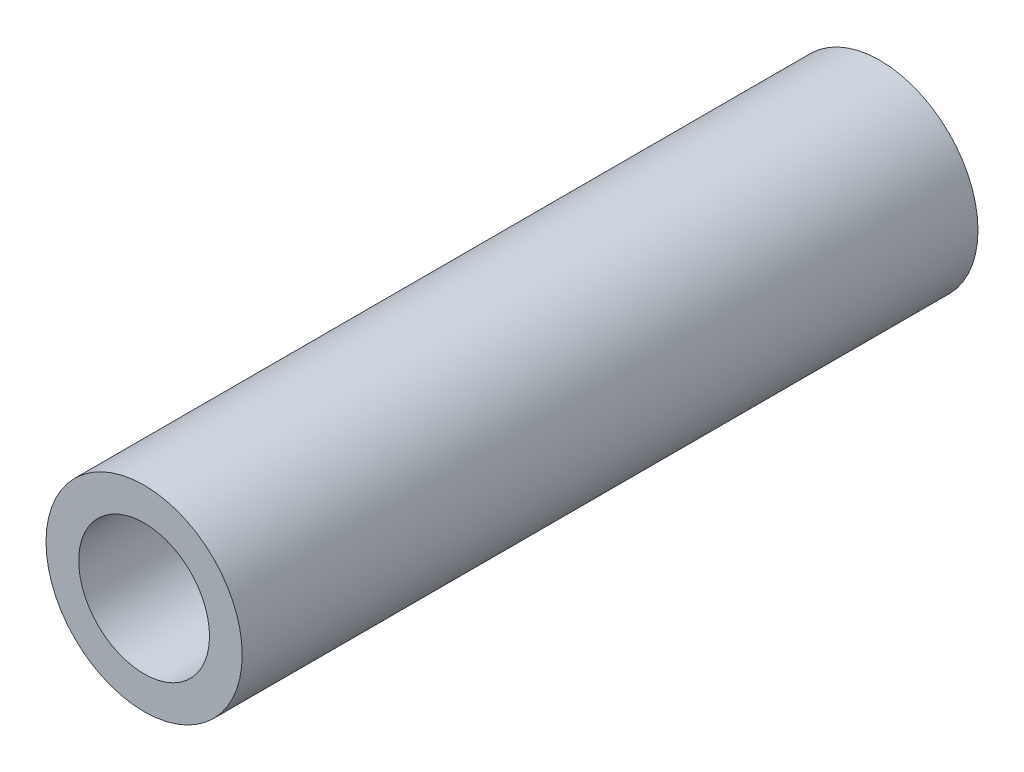
ISO-10303-21;
HEADER;
FILE_DESCRIPTION(('STEP AP214'),'2;1');
FILE_NAME('part.step','',(''),(''),'','','');
FILE_SCHEMA(('AUTOMOTIVE_DESIGN { 1 0 10303 214 1 1 1 1 }'));
ENDSEC;
DATA;
#1=APPLICATION_CONTEXT('core data for automotive mechanical design processes');
#2=APPLICATION_PROTOCOL_DEFINITION('international standard','automotive_design',2000,#1);
#3=PRODUCT_CONTEXT('',#1,'mechanical');
#4=PRODUCT('Part','Part','',(#3));
#5=PRODUCT_RELATED_PRODUCT_CATEGORY('part','',(#4));
#6=PRODUCT_DEFINITION_FORMATION('','',#4);
#7=PRODUCT_DEFINITION_CONTEXT('part definition',#1,'design');
#8=PRODUCT_DEFINITION('design','',#6,#7);
#9=PRODUCT_DEFINITION_SHAPE('','',#8);
#10=(LENGTH_UNIT() NAMED_UNIT(*) SI_UNIT(.MILLI.,.METRE.));
#11=(NAMED_UNIT(*) PLANE_ANGLE_UNIT() SI_UNIT($,.RADIAN.));
#12=(NAMED_UNIT(*) SI_UNIT($,.STERADIAN.) SOLID_ANGLE_UNIT());
#13=UNCERTAINTY_MEASURE_WITH_UNIT(LENGTH_MEASURE(1.E-05),#10,'distance_accuracy_value','');
#14=(GEOMETRIC_REPRESENTATION_CONTEXT(3) GLOBAL_UNCERTAINTY_ASSIGNED_CONTEXT((#13)) GLOBAL_UNIT_ASSIGNED_CONTEXT((#10,
#11,#12)) REPRESENTATION_CONTEXT('',''));
#15=CARTESIAN_POINT('',(0.,0.,0.));
#16=DIRECTION('',(0.,0.,1.));
#17=DIRECTION('',(1.,0.,0.));
#18=AXIS2_PLACEMENT_3D('',#15,#16,#17);
#19=CARTESIAN_POINT('',(0.,0.,57.15));
#20=DIRECTION('',(0.,0.,1.));
#21=DIRECTION('',(1.,0.,0.));
#22=AXIS2_PLACEMENT_3D('',#19,#20,#21);
#23=PLANE('',#22);
#24=CARTESIAN_POINT('',(0.,0.,57.15));
#25=DIRECTION('',(0.,0.,1.));
#26=DIRECTION('',(1.,0.,0.));
#27=AXIS2_PLACEMENT_3D('',#24,#25,#26);
#28=CIRCLE('',#27,7.62);
#29=CARTESIAN_POINT('',(7.62,0.,57.15));
#30=VERTEX_POINT('',#29);
#31=EDGE_CURVE('E10',#30,#30,#28,.T.);
#32=ORIENTED_EDGE('',*,*,#31,.T.);
#33=EDGE_LOOP('',(#32));
#34=FACE_BOUND('',#33,.T.);
#35=CARTESIAN_POINT('',(0.,0.,57.15));
#36=DIRECTION('',(0.,0.,1.));
#37=DIRECTION('',(1.,0.,0.));
#38=AXIS2_PLACEMENT_3D('',#35,#36,#37);
#39=CIRCLE('',#38,5.08);
#40=CARTESIAN_POINT('',(5.08,0.,57.15));
#41=VERTEX_POINT('',#40);
#42=EDGE_CURVE('E41',#41,#41,#39,.T.);
#43=ORIENTED_EDGE('',*,*,#42,.F.);
#44=EDGE_LOOP('',(#43));
#45=FACE_BOUND('',#44,.T.);
#46=ADVANCED_FACE('F30',(#34,#45),#23,.T.);
#47=CARTESIAN_POINT('',(0.,0.,0.));
#48=DIRECTION('',(0.,0.,1.));
#49=DIRECTION('',(1.,0.,0.));
#50=AXIS2_PLACEMENT_3D('',#47,#48,#49);
#51=PLANE('',#50);
#52=CARTESIAN_POINT('',(0.,0.,0.));
#53=DIRECTION('',(0.,0.,1.));
#54=DIRECTION('',(1.,0.,0.));
#55=AXIS2_PLACEMENT_3D('',#52,#53,#54);
#56=CIRCLE('',#55,7.62);
#57=CARTESIAN_POINT('',(7.62,0.,0.));
#58=VERTEX_POINT('',#57);
#59=EDGE_CURVE('E34',#58,#58,#56,.T.);
#60=ORIENTED_EDGE('',*,*,#59,.F.);
#61=EDGE_LOOP('',(#60));
#62=FACE_BOUND('',#61,.T.);
#63=CARTESIAN_POINT('',(0.,0.,0.));
#64=DIRECTION('',(0.,0.,1.));
#65=DIRECTION('',(1.,0.,0.));
#66=AXIS2_PLACEMENT_3D('',#63,#64,#65);
#67=CIRCLE('',#66,5.08);
#68=CARTESIAN_POINT('',(5.08,0.,0.));
#69=VERTEX_POINT('',#68);
#70=EDGE_CURVE('E43',#69,#69,#67,.T.);
#71=ORIENTED_EDGE('',*,*,#70,.T.);
#72=EDGE_LOOP('',(#71));
#73=FACE_BOUND('',#72,.T.);
#74=ADVANCED_FACE('F53',(#62,#73),#51,.F.);
#75=CARTESIAN_POINT('',(0.,0.,57.15));
#76=DIRECTION('',(0.,0.,-1.));
#77=DIRECTION('',(-1.,0.,0.));
#78=AXIS2_PLACEMENT_3D('',#75,#76,#77);
#79=CYLINDRICAL_SURFACE('',#78,7.62);
#80=ORIENTED_EDGE('',*,*,#31,.F.);
#81=EDGE_LOOP('',(#80));
#82=FACE_BOUND('',#81,.T.);
#83=ORIENTED_EDGE('',*,*,#59,.T.);
#84=EDGE_LOOP('',(#83));
#85=FACE_BOUND('',#84,.T.);
#86=ADVANCED_FACE('F32',(#82,#85),#79,.T.);
#87=CARTESIAN_POINT('',(0.,0.,57.15));
#88=DIRECTION('',(0.,0.,-1.));
#89=DIRECTION('',(-1.,0.,0.));
#90=AXIS2_PLACEMENT_3D('',#87,#88,#89);
#91=CYLINDRICAL_SURFACE('',#90,5.08);
#92=ORIENTED_EDGE('',*,*,#42,.T.);
#93=EDGE_LOOP('',(#92));
#94=FACE_BOUND('',#93,.T.);
#95=ORIENTED_EDGE('',*,*,#70,.F.);
#96=EDGE_LOOP('',(#95));
#97=FACE_BOUND('',#96,.T.);
#98=ADVANCED_FACE('F49',(#94,#97),#91,.F.);
#99=CLOSED_SHELL('',(#46,#74,#86,#98));
#100=MANIFOLD_SOLID_BREP('B2',#99);
#101=ADVANCED_BREP_SHAPE_REPRESENTATION('',(#18,#100),#14);
#102=SHAPE_DEFINITION_REPRESENTATION(#9,#101);
ENDSEC;
END-ISO-10303-21;
